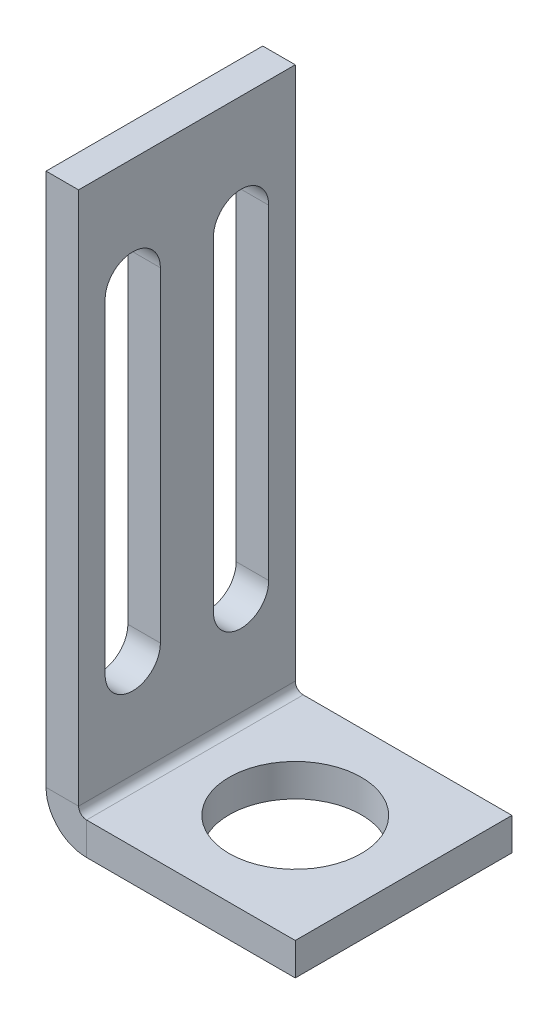
ISO-10303-21;
HEADER;
FILE_DESCRIPTION(('STEP AP214'),'2;1');
FILE_NAME('part.step','',(''),(''),'','','');
FILE_SCHEMA(('AUTOMOTIVE_DESIGN { 1 0 10303 214 1 1 1 1 }'));
ENDSEC;
DATA;
#1=APPLICATION_CONTEXT('core data for automotive mechanical design processes');
#2=APPLICATION_PROTOCOL_DEFINITION('international standard','automotive_design',2000,#1);
#3=PRODUCT_CONTEXT('',#1,'mechanical');
#4=PRODUCT('Part','Part','',(#3));
#5=PRODUCT_RELATED_PRODUCT_CATEGORY('part','',(#4));
#6=PRODUCT_DEFINITION_FORMATION('','',#4);
#7=PRODUCT_DEFINITION_CONTEXT('part definition',#1,'design');
#8=PRODUCT_DEFINITION('design','',#6,#7);
#9=PRODUCT_DEFINITION_SHAPE('','',#8);
#10=(LENGTH_UNIT() NAMED_UNIT(*) SI_UNIT(.MILLI.,.METRE.));
#11=(NAMED_UNIT(*) PLANE_ANGLE_UNIT() SI_UNIT($,.RADIAN.));
#12=(NAMED_UNIT(*) SI_UNIT($,.STERADIAN.) SOLID_ANGLE_UNIT());
#13=UNCERTAINTY_MEASURE_WITH_UNIT(LENGTH_MEASURE(1.E-05),#10,'distance_accuracy_value','');
#14=(GEOMETRIC_REPRESENTATION_CONTEXT(3) GLOBAL_UNCERTAINTY_ASSIGNED_CONTEXT((#13)) GLOBAL_UNIT_ASSIGNED_CONTEXT((#10,
#11,#12)) REPRESENTATION_CONTEXT('',''));
#15=CARTESIAN_POINT('',(0.,0.,0.));
#16=DIRECTION('',(0.,0.,1.));
#17=DIRECTION('',(1.,0.,0.));
#18=AXIS2_PLACEMENT_3D('',#15,#16,#17);
#19=CARTESIAN_POINT('',(0.7366,0.,20.));
#20=DIRECTION('',(0.,0.,1.));
#21=DIRECTION('',(1.,0.,0.));
#22=AXIS2_PLACEMENT_3D('',#19,#20,#21);
#23=PLANE('',#22);
#24=DIRECTION('',(0.,-1.,0.));
#25=VECTOR('',#24,1.);
#26=CARTESIAN_POINT('',(0.7366,0.,20.));
#27=LINE('',#26,#25);
#28=CARTESIAN_POINT('',(0.7366,0.,20.));
#29=VERTEX_POINT('',#28);
#30=CARTESIAN_POINT('',(0.7366,-3.,20.));
#31=VERTEX_POINT('',#30);
#32=EDGE_CURVE('E11',#29,#31,#27,.T.);
#33=ORIENTED_EDGE('',*,*,#32,.F.);
#34=CARTESIAN_POINT('',(0.7366,0.736599999999998,20.));
#35=DIRECTION('',(0.,0.,-1.));
#36=DIRECTION('',(-1.,0.,0.));
#37=AXIS2_PLACEMENT_3D('',#34,#35,#36);
#38=CIRCLE('',#37,0.7366);
#39=CARTESIAN_POINT('',(0.,0.736599999999997,20.));
#40=VERTEX_POINT('',#39);
#41=EDGE_CURVE('E235',#40,#29,#38,.F.);
#42=ORIENTED_EDGE('',*,*,#41,.F.);
#43=DIRECTION('',(1.,0.,0.));
#44=VECTOR('',#43,1.);
#45=CARTESIAN_POINT('',(-3.,0.736599999999992,20.));
#46=LINE('',#45,#44);
#47=CARTESIAN_POINT('',(-3.,0.736599999999992,20.));
#48=VERTEX_POINT('',#47);
#49=EDGE_CURVE('E48',#48,#40,#46,.T.);
#50=ORIENTED_EDGE('',*,*,#49,.F.);
#51=CARTESIAN_POINT('',(0.7366,0.736599999999998,20.));
#52=DIRECTION('',(0.,0.,1.));
#53=DIRECTION('',(1.,0.,0.));
#54=AXIS2_PLACEMENT_3D('',#51,#52,#53);
#55=CIRCLE('',#54,3.7366);
#56=EDGE_CURVE('E247',#48,#31,#55,.T.);
#57=ORIENTED_EDGE('',*,*,#56,.T.);
#58=EDGE_LOOP('',(#33,#42,#50,#57));
#59=FACE_BOUND('',#58,.T.);
#60=ADVANCED_FACE('F41',(#59),#23,.T.);
#61=CARTESIAN_POINT('',(-3.,0.736599999999992,20.));
#62=DIRECTION('',(0.,0.,1.));
#63=DIRECTION('',(1.,0.,0.));
#64=AXIS2_PLACEMENT_3D('',#61,#62,#63);
#65=PLANE('',#64);
#66=DIRECTION('',(1.,0.,0.));
#67=VECTOR('',#66,1.);
#68=CARTESIAN_POINT('',(0.,0.,20.));
#69=LINE('',#68,#67);
#70=CARTESIAN_POINT('',(20.,0.,20.));
#71=VERTEX_POINT('',#70);
#72=EDGE_CURVE('E232',#29,#71,#69,.T.);
#73=ORIENTED_EDGE('',*,*,#72,.F.);
#74=ORIENTED_EDGE('',*,*,#32,.T.);
#75=DIRECTION('',(1.,0.,0.));
#76=VECTOR('',#75,1.);
#77=CARTESIAN_POINT('',(0.,-3.,20.));
#78=LINE('',#77,#76);
#79=CARTESIAN_POINT('',(20.,-3.,20.));
#80=VERTEX_POINT('',#79);
#81=EDGE_CURVE('E226',#31,#80,#78,.T.);
#82=ORIENTED_EDGE('',*,*,#81,.T.);
#83=DIRECTION('',(0.,-1.,0.));
#84=VECTOR('',#83,1.);
#85=CARTESIAN_POINT('',(20.,0.,20.));
#86=LINE('',#85,#84);
#87=EDGE_CURVE('E228',#71,#80,#86,.T.);
#88=ORIENTED_EDGE('',*,*,#87,.F.);
#89=EDGE_LOOP('',(#73,#74,#82,#88));
#90=FACE_BOUND('',#89,.T.);
#91=ADVANCED_FACE('F329',(#90),#65,.T.);
#92=CARTESIAN_POINT('',(0.,0.736599999999997,0.));
#93=DIRECTION('',(0.,0.,-1.));
#94=DIRECTION('',(-1.,0.,0.));
#95=AXIS2_PLACEMENT_3D('',#92,#93,#94);
#96=PLANE('',#95);
#97=DIRECTION('',(-1.,0.,0.));
#98=VECTOR('',#97,1.);
#99=CARTESIAN_POINT('',(0.,0.736599999999997,0.));
#100=LINE('',#99,#98);
#101=CARTESIAN_POINT('',(0.,0.736599999999997,0.));
#102=VERTEX_POINT('',#101);
#103=CARTESIAN_POINT('',(-3.,0.736599999999992,0.));
#104=VERTEX_POINT('',#103);
#105=EDGE_CURVE('E294',#102,#104,#100,.T.);
#106=ORIENTED_EDGE('',*,*,#105,.F.);
#107=CARTESIAN_POINT('',(0.7366,0.736599999999998,0.));
#108=DIRECTION('',(0.,0.,-1.));
#109=DIRECTION('',(-1.,0.,0.));
#110=AXIS2_PLACEMENT_3D('',#107,#108,#109);
#111=CIRCLE('',#110,0.7366);
#112=CARTESIAN_POINT('',(0.7366,0.,0.));
#113=VERTEX_POINT('',#112);
#114=EDGE_CURVE('E259',#102,#113,#111,.F.);
#115=ORIENTED_EDGE('',*,*,#114,.T.);
#116=DIRECTION('',(0.,1.,0.));
#117=VECTOR('',#116,1.);
#118=CARTESIAN_POINT('',(0.7366,-3.,0.));
#119=LINE('',#118,#117);
#120=CARTESIAN_POINT('',(0.7366,-3.,0.));
#121=VERTEX_POINT('',#120);
#122=EDGE_CURVE('E292',#121,#113,#119,.T.);
#123=ORIENTED_EDGE('',*,*,#122,.F.);
#124=CARTESIAN_POINT('',(0.7366,0.736599999999998,0.));
#125=DIRECTION('',(0.,0.,1.));
#126=DIRECTION('',(1.,0.,0.));
#127=AXIS2_PLACEMENT_3D('',#124,#125,#126);
#128=CIRCLE('',#127,3.7366);
#129=EDGE_CURVE('E229',#104,#121,#128,.T.);
#130=ORIENTED_EDGE('',*,*,#129,.F.);
#131=EDGE_LOOP('',(#106,#115,#123,#130));
#132=FACE_BOUND('',#131,.T.);
#133=ADVANCED_FACE('F336',(#132),#96,.T.);
#134=CARTESIAN_POINT('',(0.7366,-3.,0.));
#135=DIRECTION('',(0.,0.,-1.));
#136=DIRECTION('',(-1.,0.,0.));
#137=AXIS2_PLACEMENT_3D('',#134,#135,#136);
#138=PLANE('',#137);
#139=DIRECTION('',(0.,-1.,0.));
#140=VECTOR('',#139,1.);
#141=CARTESIAN_POINT('',(0.,50.,0.));
#142=LINE('',#141,#140);
#143=CARTESIAN_POINT('',(0.,50.,0.));
#144=VERTEX_POINT('',#143);
#145=EDGE_CURVE('E262',#144,#102,#142,.T.);
#146=ORIENTED_EDGE('',*,*,#145,.T.);
#147=ORIENTED_EDGE('',*,*,#105,.T.);
#148=DIRECTION('',(0.,-1.,0.));
#149=VECTOR('',#148,1.);
#150=CARTESIAN_POINT('',(-3.,50.,0.));
#151=LINE('',#150,#149);
#152=CARTESIAN_POINT('',(-3.,50.,0.));
#153=VERTEX_POINT('',#152);
#154=EDGE_CURVE('E268',#153,#104,#151,.T.);
#155=ORIENTED_EDGE('',*,*,#154,.F.);
#156=DIRECTION('',(1.,0.,0.));
#157=VECTOR('',#156,1.);
#158=CARTESIAN_POINT('',(-3.,50.,0.));
#159=LINE('',#158,#157);
#160=EDGE_CURVE('E265',#153,#144,#159,.T.);
#161=ORIENTED_EDGE('',*,*,#160,.T.);
#162=EDGE_LOOP('',(#146,#147,#155,#161));
#163=FACE_BOUND('',#162,.T.);
#164=ADVANCED_FACE('F338',(#163),#138,.T.);
#165=CARTESIAN_POINT('',(0.,-3.,20.));
#166=DIRECTION('',(0.,1.,0.));
#167=DIRECTION('',(0.,0.,1.));
#168=AXIS2_PLACEMENT_3D('',#165,#166,#167);
#169=PLANE('',#168);
#170=CARTESIAN_POINT('',(10.,-3.,10.));
#171=DIRECTION('',(0.,1.,0.));
#172=DIRECTION('',(0.,0.,1.));
#173=AXIS2_PLACEMENT_3D('',#170,#171,#172);
#174=CIRCLE('',#173,6.1);
#175=CARTESIAN_POINT('',(10.,-3.,16.1));
#176=VERTEX_POINT('',#175);
#177=EDGE_CURVE('E222',#176,#176,#174,.F.);
#178=ORIENTED_EDGE('',*,*,#177,.F.);
#179=EDGE_LOOP('',(#178));
#180=FACE_BOUND('',#179,.T.);
#181=DIRECTION('',(1.,0.,0.));
#182=VECTOR('',#181,1.);
#183=CARTESIAN_POINT('',(0.,-3.,0.));
#184=LINE('',#183,#182);
#185=CARTESIAN_POINT('',(20.,-3.,0.));
#186=VERTEX_POINT('',#185);
#187=EDGE_CURVE('E225',#121,#186,#184,.T.);
#188=ORIENTED_EDGE('',*,*,#187,.T.);
#189=DIRECTION('',(0.,0.,-1.));
#190=VECTOR('',#189,1.);
#191=CARTESIAN_POINT('',(20.,-3.,20.));
#192=LINE('',#191,#190);
#193=EDGE_CURVE('E290',#80,#186,#192,.T.);
#194=ORIENTED_EDGE('',*,*,#193,.F.);
#195=ORIENTED_EDGE('',*,*,#81,.F.);
#196=DIRECTION('',(0.,0.,-1.));
#197=VECTOR('',#196,1.);
#198=CARTESIAN_POINT('',(0.7366,-3.,20.));
#199=LINE('',#198,#197);
#200=EDGE_CURVE('E250',#31,#121,#199,.T.);
#201=ORIENTED_EDGE('',*,*,#200,.T.);
#202=EDGE_LOOP('',(#188,#194,#195,#201));
#203=FACE_BOUND('',#202,.T.);
#204=ADVANCED_FACE('F325',(#180,#203),#169,.F.);
#205=CARTESIAN_POINT('',(20.,0.,20.));
#206=DIRECTION('',(1.,0.,0.));
#207=DIRECTION('',(0.,0.,-1.));
#208=AXIS2_PLACEMENT_3D('',#205,#206,#207);
#209=PLANE('',#208);
#210=DIRECTION('',(0.,-1.,0.));
#211=VECTOR('',#210,1.);
#212=CARTESIAN_POINT('',(20.,0.,0.));
#213=LINE('',#212,#211);
#214=CARTESIAN_POINT('',(20.,0.,0.));
#215=VERTEX_POINT('',#214);
#216=EDGE_CURVE('E253',#215,#186,#213,.T.);
#217=ORIENTED_EDGE('',*,*,#216,.F.);
#218=DIRECTION('',(0.,0.,-1.));
#219=VECTOR('',#218,1.);
#220=CARTESIAN_POINT('',(20.,0.,20.));
#221=LINE('',#220,#219);
#222=EDGE_CURVE('E288',#71,#215,#221,.T.);
#223=ORIENTED_EDGE('',*,*,#222,.F.);
#224=ORIENTED_EDGE('',*,*,#87,.T.);
#225=ORIENTED_EDGE('',*,*,#193,.T.);
#226=EDGE_LOOP('',(#217,#223,#224,#225));
#227=FACE_BOUND('',#226,.T.);
#228=ADVANCED_FACE('F345',(#227),#209,.T.);
#229=CARTESIAN_POINT('',(0.,0.,20.));
#230=DIRECTION('',(0.,1.,0.));
#231=DIRECTION('',(0.,0.,1.));
#232=AXIS2_PLACEMENT_3D('',#229,#230,#231);
#233=PLANE('',#232);
#234=CARTESIAN_POINT('',(10.,0.,10.));
#235=DIRECTION('',(0.,1.,0.));
#236=DIRECTION('',(0.,0.,1.));
#237=AXIS2_PLACEMENT_3D('',#234,#235,#236);
#238=CIRCLE('',#237,6.1);
#239=CARTESIAN_POINT('',(10.,0.,16.1));
#240=VERTEX_POINT('',#239);
#241=EDGE_CURVE('E219',#240,#240,#238,.T.);
#242=ORIENTED_EDGE('',*,*,#241,.F.);
#243=EDGE_LOOP('',(#242));
#244=FACE_BOUND('',#243,.T.);
#245=DIRECTION('',(1.,0.,0.));
#246=VECTOR('',#245,1.);
#247=CARTESIAN_POINT('',(0.,0.,0.));
#248=LINE('',#247,#246);
#249=EDGE_CURVE('E256',#113,#215,#248,.T.);
#250=ORIENTED_EDGE('',*,*,#249,.F.);
#251=DIRECTION('',(0.,0.,-1.));
#252=VECTOR('',#251,1.);
#253=CARTESIAN_POINT('',(0.7366,0.,20.));
#254=LINE('',#253,#252);
#255=EDGE_CURVE('E285',#29,#113,#254,.T.);
#256=ORIENTED_EDGE('',*,*,#255,.F.);
#257=ORIENTED_EDGE('',*,*,#72,.T.);
#258=ORIENTED_EDGE('',*,*,#222,.T.);
#259=EDGE_LOOP('',(#250,#256,#257,#258));
#260=FACE_BOUND('',#259,.T.);
#261=ADVANCED_FACE('F332',(#244,#260),#233,.T.);
#262=CARTESIAN_POINT('',(0.7366,0.736599999999998,20.));
#263=DIRECTION('',(0.,0.,-1.));
#264=DIRECTION('',(-1.,0.,0.));
#265=AXIS2_PLACEMENT_3D('',#262,#263,#264);
#266=CYLINDRICAL_SURFACE('',#265,0.7366);
#267=ORIENTED_EDGE('',*,*,#114,.F.);
#268=DIRECTION('',(0.,0.,-1.));
#269=VECTOR('',#268,1.);
#270=CARTESIAN_POINT('',(0.,0.736599999999997,20.));
#271=LINE('',#270,#269);
#272=EDGE_CURVE('E282',#40,#102,#271,.T.);
#273=ORIENTED_EDGE('',*,*,#272,.F.);
#274=ORIENTED_EDGE('',*,*,#41,.T.);
#275=ORIENTED_EDGE('',*,*,#255,.T.);
#276=EDGE_LOOP('',(#267,#273,#274,#275));
#277=FACE_BOUND('',#276,.T.);
#278=ADVANCED_FACE('F306',(#277),#266,.F.);
#279=CARTESIAN_POINT('',(0.,50.,20.));
#280=DIRECTION('',(1.,0.,0.));
#281=DIRECTION('',(0.,1.,0.));
#282=AXIS2_PLACEMENT_3D('',#279,#280,#281);
#283=PLANE('',#282);
#284=CARTESIAN_POINT('',(0.,40.,5.));
#285=DIRECTION('',(1.,0.,0.));
#286=DIRECTION('',(0.,0.,-1.));
#287=AXIS2_PLACEMENT_3D('',#284,#285,#286);
#288=CIRCLE('',#287,2.55);
#289=CARTESIAN_POINT('',(0.,40.,2.45));
#290=VERTEX_POINT('',#289);
#291=CARTESIAN_POINT('',(0.,40.,7.55));
#292=VERTEX_POINT('',#291);
#293=EDGE_CURVE('E55',#290,#292,#288,.T.);
#294=ORIENTED_EDGE('',*,*,#293,.F.);
#295=DIRECTION('',(0.,1.,0.));
#296=VECTOR('',#295,1.);
#297=CARTESIAN_POINT('',(0.,40.,2.45));
#298=LINE('',#297,#296);
#299=CARTESIAN_POINT('',(0.,10.,2.45));
#300=VERTEX_POINT('',#299);
#301=EDGE_CURVE('E160',#300,#290,#298,.T.);
#302=ORIENTED_EDGE('',*,*,#301,.F.);
#303=CARTESIAN_POINT('',(0.,10.,5.));
#304=DIRECTION('',(1.,0.,0.));
#305=DIRECTION('',(0.,0.,-1.));
#306=AXIS2_PLACEMENT_3D('',#303,#304,#305);
#307=CIRCLE('',#306,2.55);
#308=CARTESIAN_POINT('',(0.,10.,7.55));
#309=VERTEX_POINT('',#308);
#310=EDGE_CURVE('E180',#309,#300,#307,.T.);
#311=ORIENTED_EDGE('',*,*,#310,.F.);
#312=DIRECTION('',(0.,-1.,0.));
#313=VECTOR('',#312,1.);
#314=CARTESIAN_POINT('',(0.,40.,7.55));
#315=LINE('',#314,#313);
#316=EDGE_CURVE('E174',#292,#309,#315,.T.);
#317=ORIENTED_EDGE('',*,*,#316,.F.);
#318=EDGE_LOOP('',(#294,#302,#311,#317));
#319=FACE_BOUND('',#318,.T.);
#320=CARTESIAN_POINT('',(0.,40.,15.));
#321=DIRECTION('',(1.,0.,0.));
#322=DIRECTION('',(0.,0.,-1.));
#323=AXIS2_PLACEMENT_3D('',#320,#321,#322);
#324=CIRCLE('',#323,2.55);
#325=CARTESIAN_POINT('',(0.,40.,12.45));
#326=VERTEX_POINT('',#325);
#327=CARTESIAN_POINT('',(0.,40.,17.55));
#328=VERTEX_POINT('',#327);
#329=EDGE_CURVE('E196',#326,#328,#324,.T.);
#330=ORIENTED_EDGE('',*,*,#329,.F.);
#331=DIRECTION('',(0.,1.,0.));
#332=VECTOR('',#331,1.);
#333=CARTESIAN_POINT('',(0.,40.,12.45));
#334=LINE('',#333,#332);
#335=CARTESIAN_POINT('',(0.,10.,12.45));
#336=VERTEX_POINT('',#335);
#337=EDGE_CURVE('E204',#336,#326,#334,.T.);
#338=ORIENTED_EDGE('',*,*,#337,.F.);
#339=CARTESIAN_POINT('',(0.,10.,15.));
#340=DIRECTION('',(1.,0.,0.));
#341=DIRECTION('',(0.,0.,-1.));
#342=AXIS2_PLACEMENT_3D('',#339,#340,#341);
#343=CIRCLE('',#342,2.55);
#344=CARTESIAN_POINT('',(0.,10.,17.55));
#345=VERTEX_POINT('',#344);
#346=EDGE_CURVE('E201',#345,#336,#343,.T.);
#347=ORIENTED_EDGE('',*,*,#346,.F.);
#348=DIRECTION('',(0.,-1.,0.));
#349=VECTOR('',#348,1.);
#350=CARTESIAN_POINT('',(0.,40.,17.55));
#351=LINE('',#350,#349);
#352=EDGE_CURVE('E198',#328,#345,#351,.T.);
#353=ORIENTED_EDGE('',*,*,#352,.F.);
#354=EDGE_LOOP('',(#330,#338,#347,#353));
#355=FACE_BOUND('',#354,.T.);
#356=ORIENTED_EDGE('',*,*,#145,.F.);
#357=DIRECTION('',(0.,0.,-1.));
#358=VECTOR('',#357,1.);
#359=CARTESIAN_POINT('',(0.,50.,20.));
#360=LINE('',#359,#358);
#361=CARTESIAN_POINT('',(0.,50.,20.));
#362=VERTEX_POINT('',#361);
#363=EDGE_CURVE('E280',#362,#144,#360,.T.);
#364=ORIENTED_EDGE('',*,*,#363,.F.);
#365=DIRECTION('',(0.,-1.,0.));
#366=VECTOR('',#365,1.);
#367=CARTESIAN_POINT('',(0.,50.,20.));
#368=LINE('',#367,#366);
#369=EDGE_CURVE('E238',#362,#40,#368,.T.);
#370=ORIENTED_EDGE('',*,*,#369,.T.);
#371=ORIENTED_EDGE('',*,*,#272,.T.);
#372=EDGE_LOOP('',(#356,#364,#370,#371));
#373=FACE_BOUND('',#372,.T.);
#374=ADVANCED_FACE('F310',(#319,#355,#373),#283,.T.);
#375=CARTESIAN_POINT('',(-3.,50.,20.));
#376=DIRECTION('',(0.,1.,0.));
#377=DIRECTION('',(0.,0.,1.));
#378=AXIS2_PLACEMENT_3D('',#375,#376,#377);
#379=PLANE('',#378);
#380=ORIENTED_EDGE('',*,*,#160,.F.);
#381=DIRECTION('',(0.,0.,-1.));
#382=VECTOR('',#381,1.);
#383=CARTESIAN_POINT('',(-3.,50.,20.));
#384=LINE('',#383,#382);
#385=CARTESIAN_POINT('',(-3.,50.,20.));
#386=VERTEX_POINT('',#385);
#387=EDGE_CURVE('E278',#386,#153,#384,.T.);
#388=ORIENTED_EDGE('',*,*,#387,.F.);
#389=DIRECTION('',(1.,0.,0.));
#390=VECTOR('',#389,1.);
#391=CARTESIAN_POINT('',(-3.,50.,20.));
#392=LINE('',#391,#390);
#393=EDGE_CURVE('E241',#386,#362,#392,.T.);
#394=ORIENTED_EDGE('',*,*,#393,.T.);
#395=ORIENTED_EDGE('',*,*,#363,.T.);
#396=EDGE_LOOP('',(#380,#388,#394,#395));
#397=FACE_BOUND('',#396,.T.);
#398=ADVANCED_FACE('F313',(#397),#379,.T.);
#399=CARTESIAN_POINT('',(-3.,50.,20.));
#400=DIRECTION('',(1.,0.,0.));
#401=DIRECTION('',(0.,1.,0.));
#402=AXIS2_PLACEMENT_3D('',#399,#400,#401);
#403=PLANE('',#402);
#404=DIRECTION('',(0.,-1.,0.));
#405=VECTOR('',#404,1.);
#406=CARTESIAN_POINT('',(-3.,40.,2.45));
#407=LINE('',#406,#405);
#408=CARTESIAN_POINT('',(-3.,40.,2.45));
#409=VERTEX_POINT('',#408);
#410=CARTESIAN_POINT('',(-3.,10.,2.45));
#411=VERTEX_POINT('',#410);
#412=EDGE_CURVE('E172',#409,#411,#407,.T.);
#413=ORIENTED_EDGE('',*,*,#412,.F.);
#414=CARTESIAN_POINT('',(-3.,40.,5.));
#415=DIRECTION('',(1.,0.,0.));
#416=DIRECTION('',(0.,1.,0.));
#417=AXIS2_PLACEMENT_3D('',#414,#415,#416);
#418=CIRCLE('',#417,2.55);
#419=CARTESIAN_POINT('',(-3.,40.,7.55));
#420=VERTEX_POINT('',#419);
#421=EDGE_CURVE('E154',#420,#409,#418,.F.);
#422=ORIENTED_EDGE('',*,*,#421,.F.);
#423=DIRECTION('',(0.,1.,0.));
#424=VECTOR('',#423,1.);
#425=CARTESIAN_POINT('',(-3.,40.,7.55));
#426=LINE('',#425,#424);
#427=CARTESIAN_POINT('',(-3.,10.,7.55));
#428=VERTEX_POINT('',#427);
#429=EDGE_CURVE('E163',#428,#420,#426,.T.);
#430=ORIENTED_EDGE('',*,*,#429,.F.);
#431=CARTESIAN_POINT('',(-3.,10.,5.));
#432=DIRECTION('',(1.,0.,0.));
#433=DIRECTION('',(0.,1.,0.));
#434=AXIS2_PLACEMENT_3D('',#431,#432,#433);
#435=CIRCLE('',#434,2.55);
#436=EDGE_CURVE('E63',#411,#428,#435,.F.);
#437=ORIENTED_EDGE('',*,*,#436,.F.);
#438=EDGE_LOOP('',(#413,#422,#430,#437));
#439=FACE_BOUND('',#438,.T.);
#440=DIRECTION('',(0.,-1.,0.));
#441=VECTOR('',#440,1.);
#442=CARTESIAN_POINT('',(-3.,40.,12.45));
#443=LINE('',#442,#441);
#444=CARTESIAN_POINT('',(-3.,40.,12.45));
#445=VERTEX_POINT('',#444);
#446=CARTESIAN_POINT('',(-3.,10.,12.45));
#447=VERTEX_POINT('',#446);
#448=EDGE_CURVE('E190',#445,#447,#443,.T.);
#449=ORIENTED_EDGE('',*,*,#448,.F.);
#450=CARTESIAN_POINT('',(-3.,40.,15.));
#451=DIRECTION('',(1.,0.,0.));
#452=DIRECTION('',(0.,1.,0.));
#453=AXIS2_PLACEMENT_3D('',#450,#451,#452);
#454=CIRCLE('',#453,2.55);
#455=CARTESIAN_POINT('',(-3.,40.,17.55));
#456=VERTEX_POINT('',#455);
#457=EDGE_CURVE('E193',#456,#445,#454,.F.);
#458=ORIENTED_EDGE('',*,*,#457,.F.);
#459=DIRECTION('',(0.,1.,0.));
#460=VECTOR('',#459,1.);
#461=CARTESIAN_POINT('',(-3.,40.,17.55));
#462=LINE('',#461,#460);
#463=CARTESIAN_POINT('',(-3.,10.,17.55));
#464=VERTEX_POINT('',#463);
#465=EDGE_CURVE('E210',#464,#456,#462,.T.);
#466=ORIENTED_EDGE('',*,*,#465,.F.);
#467=CARTESIAN_POINT('',(-3.,10.,15.));
#468=DIRECTION('',(1.,0.,0.));
#469=DIRECTION('',(0.,1.,0.));
#470=AXIS2_PLACEMENT_3D('',#467,#468,#469);
#471=CIRCLE('',#470,2.55);
#472=EDGE_CURVE('E166',#447,#464,#471,.F.);
#473=ORIENTED_EDGE('',*,*,#472,.F.);
#474=EDGE_LOOP('',(#449,#458,#466,#473));
#475=FACE_BOUND('',#474,.T.);
#476=ORIENTED_EDGE('',*,*,#154,.T.);
#477=DIRECTION('',(0.,0.,-1.));
#478=VECTOR('',#477,1.);
#479=CARTESIAN_POINT('',(-3.,0.736599999999992,20.));
#480=LINE('',#479,#478);
#481=EDGE_CURVE('E275',#48,#104,#480,.T.);
#482=ORIENTED_EDGE('',*,*,#481,.F.);
#483=DIRECTION('',(0.,-1.,0.));
#484=VECTOR('',#483,1.);
#485=CARTESIAN_POINT('',(-3.,50.,20.));
#486=LINE('',#485,#484);
#487=EDGE_CURVE('E244',#386,#48,#486,.T.);
#488=ORIENTED_EDGE('',*,*,#487,.F.);
#489=ORIENTED_EDGE('',*,*,#387,.T.);
#490=EDGE_LOOP('',(#476,#482,#488,#489));
#491=FACE_BOUND('',#490,.T.);
#492=ADVANCED_FACE('F169',(#439,#475,#491),#403,.F.);
#493=CARTESIAN_POINT('',(0.7366,0.736599999999998,20.));
#494=DIRECTION('',(0.,0.,-1.));
#495=DIRECTION('',(-1.,0.,0.));
#496=AXIS2_PLACEMENT_3D('',#493,#494,#495);
#497=CYLINDRICAL_SURFACE('',#496,3.7366);
#498=ORIENTED_EDGE('',*,*,#129,.T.);
#499=ORIENTED_EDGE('',*,*,#200,.F.);
#500=ORIENTED_EDGE('',*,*,#56,.F.);
#501=ORIENTED_EDGE('',*,*,#481,.T.);
#502=EDGE_LOOP('',(#498,#499,#500,#501));
#503=FACE_BOUND('',#502,.T.);
#504=ADVANCED_FACE('F320',(#503),#497,.T.);
#505=CARTESIAN_POINT('',(0.7366,0.736599999999998,20.));
#506=DIRECTION('',(0.,0.,-1.));
#507=DIRECTION('',(-1.,0.,0.));
#508=AXIS2_PLACEMENT_3D('',#505,#506,#507);
#509=PLANE('',#508);
#510=ORIENTED_EDGE('',*,*,#487,.T.);
#511=ORIENTED_EDGE('',*,*,#49,.T.);
#512=ORIENTED_EDGE('',*,*,#369,.F.);
#513=ORIENTED_EDGE('',*,*,#393,.F.);
#514=EDGE_LOOP('',(#510,#511,#512,#513));
#515=FACE_BOUND('',#514,.T.);
#516=ADVANCED_FACE('F298',(#515),#509,.F.);
#517=CARTESIAN_POINT('',(0.7366,0.736599999999998,0.));
#518=DIRECTION('',(0.,0.,-1.));
#519=DIRECTION('',(-1.,0.,0.));
#520=AXIS2_PLACEMENT_3D('',#517,#518,#519);
#521=PLANE('',#520);
#522=ORIENTED_EDGE('',*,*,#187,.F.);
#523=ORIENTED_EDGE('',*,*,#122,.T.);
#524=ORIENTED_EDGE('',*,*,#249,.T.);
#525=ORIENTED_EDGE('',*,*,#216,.T.);
#526=EDGE_LOOP('',(#522,#523,#524,#525));
#527=FACE_BOUND('',#526,.T.);
#528=ADVANCED_FACE('F418',(#527),#521,.T.);
#529=CARTESIAN_POINT('',(10.,-3.001,10.));
#530=DIRECTION('',(0.,1.,0.));
#531=DIRECTION('',(0.,0.,1.));
#532=AXIS2_PLACEMENT_3D('',#529,#530,#531);
#533=CYLINDRICAL_SURFACE('',#532,6.1);
#534=ORIENTED_EDGE('',*,*,#241,.T.);
#535=EDGE_LOOP('',(#534));
#536=FACE_BOUND('',#535,.T.);
#537=ORIENTED_EDGE('',*,*,#177,.T.);
#538=EDGE_LOOP('',(#537));
#539=FACE_BOUND('',#538,.T.);
#540=ADVANCED_FACE('F428',(#536,#539),#533,.F.);
#541=CARTESIAN_POINT('',(-3.001,40.,15.));
#542=DIRECTION('',(1.,0.,0.));
#543=DIRECTION('',(0.,0.,-1.));
#544=AXIS2_PLACEMENT_3D('',#541,#542,#543);
#545=CYLINDRICAL_SURFACE('',#544,2.55);
#546=ORIENTED_EDGE('',*,*,#457,.T.);
#547=DIRECTION('',(1.,0.,0.));
#548=VECTOR('',#547,1.);
#549=CARTESIAN_POINT('',(-3.001,40.,12.45));
#550=LINE('',#549,#548);
#551=EDGE_CURVE('E208',#445,#326,#550,.T.);
#552=ORIENTED_EDGE('',*,*,#551,.T.);
#553=ORIENTED_EDGE('',*,*,#329,.T.);
#554=DIRECTION('',(1.,0.,0.));
#555=VECTOR('',#554,1.);
#556=CARTESIAN_POINT('',(-3.001,40.,17.55));
#557=LINE('',#556,#555);
#558=EDGE_CURVE('E207',#456,#328,#557,.T.);
#559=ORIENTED_EDGE('',*,*,#558,.F.);
#560=EDGE_LOOP('',(#546,#552,#553,#559));
#561=FACE_BOUND('',#560,.T.);
#562=ADVANCED_FACE('F452',(#561),#545,.F.);
#563=CARTESIAN_POINT('',(-3.001,40.,12.45));
#564=DIRECTION('',(0.,0.,-1.));
#565=DIRECTION('',(-1.,0.,0.));
#566=AXIS2_PLACEMENT_3D('',#563,#564,#565);
#567=PLANE('',#566);
#568=ORIENTED_EDGE('',*,*,#448,.T.);
#569=DIRECTION('',(1.,0.,0.));
#570=VECTOR('',#569,1.);
#571=CARTESIAN_POINT('',(-3.001,10.,12.45));
#572=LINE('',#571,#570);
#573=EDGE_CURVE('E211',#447,#336,#572,.T.);
#574=ORIENTED_EDGE('',*,*,#573,.T.);
#575=ORIENTED_EDGE('',*,*,#337,.T.);
#576=ORIENTED_EDGE('',*,*,#551,.F.);
#577=EDGE_LOOP('',(#568,#574,#575,#576));
#578=FACE_BOUND('',#577,.T.);
#579=ADVANCED_FACE('F478',(#578),#567,.F.);
#580=CARTESIAN_POINT('',(-3.001,10.,15.));
#581=DIRECTION('',(1.,0.,0.));
#582=DIRECTION('',(0.,0.,-1.));
#583=AXIS2_PLACEMENT_3D('',#580,#581,#582);
#584=CYLINDRICAL_SURFACE('',#583,2.55);
#585=ORIENTED_EDGE('',*,*,#472,.T.);
#586=DIRECTION('',(1.,0.,0.));
#587=VECTOR('',#586,1.);
#588=CARTESIAN_POINT('',(-3.001,10.,17.55));
#589=LINE('',#588,#587);
#590=EDGE_CURVE('E213',#464,#345,#589,.T.);
#591=ORIENTED_EDGE('',*,*,#590,.T.);
#592=ORIENTED_EDGE('',*,*,#346,.T.);
#593=ORIENTED_EDGE('',*,*,#573,.F.);
#594=EDGE_LOOP('',(#585,#591,#592,#593));
#595=FACE_BOUND('',#594,.T.);
#596=ADVANCED_FACE('F489',(#595),#584,.F.);
#597=CARTESIAN_POINT('',(-3.001,40.,17.55));
#598=DIRECTION('',(0.,0.,1.));
#599=DIRECTION('',(0.,-1.,0.));
#600=AXIS2_PLACEMENT_3D('',#597,#598,#599);
#601=PLANE('',#600);
#602=ORIENTED_EDGE('',*,*,#465,.T.);
#603=ORIENTED_EDGE('',*,*,#558,.T.);
#604=ORIENTED_EDGE('',*,*,#352,.T.);
#605=ORIENTED_EDGE('',*,*,#590,.F.);
#606=EDGE_LOOP('',(#602,#603,#604,#605));
#607=FACE_BOUND('',#606,.T.);
#608=ADVANCED_FACE('F500',(#607),#601,.F.);
#609=CARTESIAN_POINT('',(-3.001,40.,5.));
#610=DIRECTION('',(1.,0.,0.));
#611=DIRECTION('',(0.,0.,-1.));
#612=AXIS2_PLACEMENT_3D('',#609,#610,#611);
#613=CYLINDRICAL_SURFACE('',#612,2.55);
#614=ORIENTED_EDGE('',*,*,#421,.T.);
#615=DIRECTION('',(1.,0.,0.));
#616=VECTOR('',#615,1.);
#617=CARTESIAN_POINT('',(-3.001,40.,2.45));
#618=LINE('',#617,#616);
#619=EDGE_CURVE('E167',#409,#290,#618,.T.);
#620=ORIENTED_EDGE('',*,*,#619,.T.);
#621=ORIENTED_EDGE('',*,*,#293,.T.);
#622=DIRECTION('',(1.,0.,0.));
#623=VECTOR('',#622,1.);
#624=CARTESIAN_POINT('',(-3.001,40.,7.55));
#625=LINE('',#624,#623);
#626=EDGE_CURVE('E150',#420,#292,#625,.T.);
#627=ORIENTED_EDGE('',*,*,#626,.F.);
#628=EDGE_LOOP('',(#614,#620,#621,#627));
#629=FACE_BOUND('',#628,.T.);
#630=ADVANCED_FACE('F152',(#629),#613,.F.);
#631=CARTESIAN_POINT('',(-3.001,40.,2.45));
#632=DIRECTION('',(0.,0.,-1.));
#633=DIRECTION('',(0.,1.,0.));
#634=AXIS2_PLACEMENT_3D('',#631,#632,#633);
#635=PLANE('',#634);
#636=ORIENTED_EDGE('',*,*,#412,.T.);
#637=DIRECTION('',(1.,0.,0.));
#638=VECTOR('',#637,1.);
#639=CARTESIAN_POINT('',(-3.001,10.,2.45));
#640=LINE('',#639,#638);
#641=EDGE_CURVE('E186',#411,#300,#640,.T.);
#642=ORIENTED_EDGE('',*,*,#641,.T.);
#643=ORIENTED_EDGE('',*,*,#301,.T.);
#644=ORIENTED_EDGE('',*,*,#619,.F.);
#645=EDGE_LOOP('',(#636,#642,#643,#644));
#646=FACE_BOUND('',#645,.T.);
#647=ADVANCED_FACE('F521',(#646),#635,.F.);
#648=CARTESIAN_POINT('',(-3.001,10.,5.));
#649=DIRECTION('',(1.,0.,0.));
#650=DIRECTION('',(0.,0.,-1.));
#651=AXIS2_PLACEMENT_3D('',#648,#649,#650);
#652=CYLINDRICAL_SURFACE('',#651,2.55);
#653=ORIENTED_EDGE('',*,*,#436,.T.);
#654=DIRECTION('',(1.,0.,0.));
#655=VECTOR('',#654,1.);
#656=CARTESIAN_POINT('',(-3.001,10.,7.55));
#657=LINE('',#656,#655);
#658=EDGE_CURVE('E159',#428,#309,#657,.T.);
#659=ORIENTED_EDGE('',*,*,#658,.T.);
#660=ORIENTED_EDGE('',*,*,#310,.T.);
#661=ORIENTED_EDGE('',*,*,#641,.F.);
#662=EDGE_LOOP('',(#653,#659,#660,#661));
#663=FACE_BOUND('',#662,.T.);
#664=ADVANCED_FACE('F531',(#663),#652,.F.);
#665=CARTESIAN_POINT('',(-3.001,40.,7.55));
#666=DIRECTION('',(0.,0.,1.));
#667=DIRECTION('',(0.,-1.,0.));
#668=AXIS2_PLACEMENT_3D('',#665,#666,#667);
#669=PLANE('',#668);
#670=ORIENTED_EDGE('',*,*,#429,.T.);
#671=ORIENTED_EDGE('',*,*,#626,.T.);
#672=ORIENTED_EDGE('',*,*,#316,.T.);
#673=ORIENTED_EDGE('',*,*,#658,.F.);
#674=EDGE_LOOP('',(#670,#671,#672,#673));
#675=FACE_BOUND('',#674,.T.);
#676=ADVANCED_FACE('F164',(#675),#669,.F.);
#677=CLOSED_SHELL('',(#60,#91,#133,#164,#204,#228,#261,#278,#374,#398,#492,#504,#516,#528,#540,
#562,#579,#596,#608,#630,#647,#664,#676));
#678=MANIFOLD_SOLID_BREP('B2',#677);
#679=ADVANCED_BREP_SHAPE_REPRESENTATION('',(#18,#678),#14);
#680=SHAPE_DEFINITION_REPRESENTATION(#9,#679);
ENDSEC;
END-ISO-10303-21;
